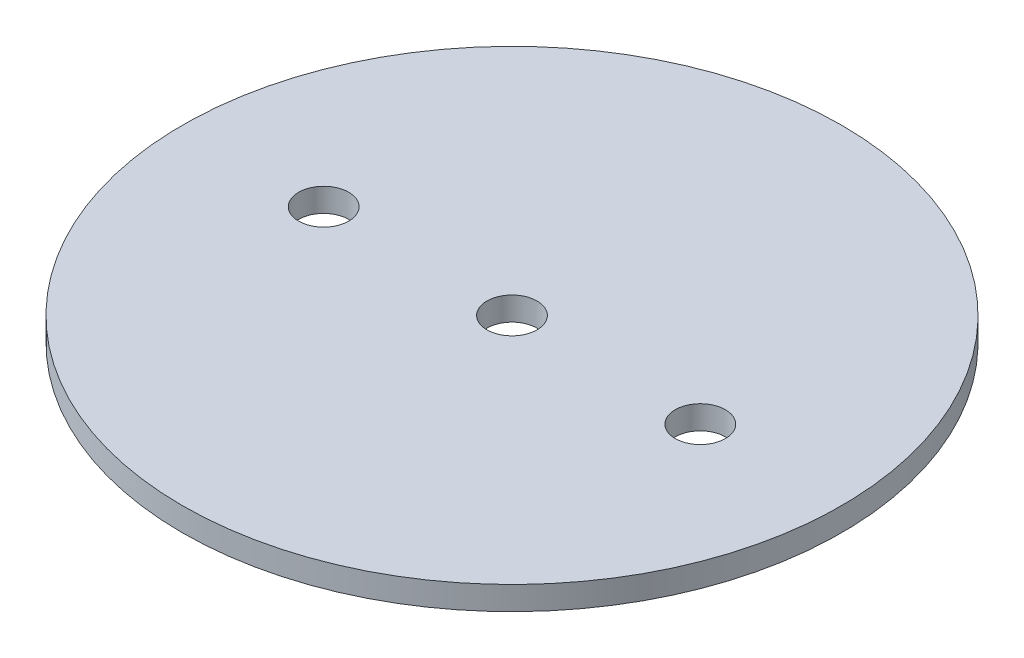
ISO-10303-21;
HEADER;
FILE_DESCRIPTION(('STEP AP214'),'2;1');
FILE_NAME('part.step','',(''),(''),'','','');
FILE_SCHEMA(('AUTOMOTIVE_DESIGN { 1 0 10303 214 1 1 1 1 }'));
ENDSEC;
DATA;
#1=APPLICATION_CONTEXT('core data for automotive mechanical design processes');
#2=APPLICATION_PROTOCOL_DEFINITION('international standard','automotive_design',2000,#1);
#3=PRODUCT_CONTEXT('',#1,'mechanical');
#4=PRODUCT('Part','Part','',(#3));
#5=PRODUCT_RELATED_PRODUCT_CATEGORY('part','',(#4));
#6=PRODUCT_DEFINITION_FORMATION('','',#4);
#7=PRODUCT_DEFINITION_CONTEXT('part definition',#1,'design');
#8=PRODUCT_DEFINITION('design','',#6,#7);
#9=PRODUCT_DEFINITION_SHAPE('','',#8);
#10=(LENGTH_UNIT() NAMED_UNIT(*) SI_UNIT(.MILLI.,.METRE.));
#11=(NAMED_UNIT(*) PLANE_ANGLE_UNIT() SI_UNIT($,.RADIAN.));
#12=(NAMED_UNIT(*) SI_UNIT($,.STERADIAN.) SOLID_ANGLE_UNIT());
#13=UNCERTAINTY_MEASURE_WITH_UNIT(LENGTH_MEASURE(1.E-05),#10,'distance_accuracy_value','');
#14=(GEOMETRIC_REPRESENTATION_CONTEXT(3) GLOBAL_UNCERTAINTY_ASSIGNED_CONTEXT((#13)) GLOBAL_UNIT_ASSIGNED_CONTEXT((#10,
#11,#12)) REPRESENTATION_CONTEXT('',''));
#15=CARTESIAN_POINT('',(0.,0.,0.));
#16=DIRECTION('',(0.,0.,1.));
#17=DIRECTION('',(1.,0.,0.));
#18=AXIS2_PLACEMENT_3D('',#15,#16,#17);
#19=CARTESIAN_POINT('',(0.,1.5875,0.));
#20=DIRECTION('',(0.,-1.,0.));
#21=DIRECTION('',(0.,0.,-1.));
#22=AXIS2_PLACEMENT_3D('',#19,#20,#21);
#23=CYLINDRICAL_SURFACE('',#22,44.45);
#24=CARTESIAN_POINT('',(0.,1.5875,0.));
#25=DIRECTION('',(0.,1.,0.));
#26=DIRECTION('',(0.,0.,1.));
#27=AXIS2_PLACEMENT_3D('',#24,#25,#26);
#28=CIRCLE('',#27,44.45);
#29=CARTESIAN_POINT('',(0.,1.5875,44.45));
#30=VERTEX_POINT('',#29);
#31=EDGE_CURVE('E10',#30,#30,#28,.T.);
#32=ORIENTED_EDGE('',*,*,#31,.F.);
#33=EDGE_LOOP('',(#32));
#34=FACE_BOUND('',#33,.T.);
#35=CARTESIAN_POINT('',(0.,-1.5875,0.));
#36=DIRECTION('',(0.,1.,0.));
#37=DIRECTION('',(0.,0.,1.));
#38=AXIS2_PLACEMENT_3D('',#35,#36,#37);
#39=CIRCLE('',#38,44.45);
#40=CARTESIAN_POINT('',(0.,-1.5875,44.45));
#41=VERTEX_POINT('',#40);
#42=EDGE_CURVE('E51',#41,#41,#39,.T.);
#43=ORIENTED_EDGE('',*,*,#42,.T.);
#44=EDGE_LOOP('',(#43));
#45=FACE_BOUND('',#44,.T.);
#46=ADVANCED_FACE('F43',(#34,#45),#23,.T.);
#47=CARTESIAN_POINT('',(0.,1.5875,0.));
#48=DIRECTION('',(0.,1.,0.));
#49=DIRECTION('',(0.,0.,1.));
#50=AXIS2_PLACEMENT_3D('',#47,#48,#49);
#51=PLANE('',#50);
#52=CARTESIAN_POINT('',(0.,1.5875,0.));
#53=DIRECTION('',(0.,1.,0.));
#54=DIRECTION('',(0.,0.,1.));
#55=AXIS2_PLACEMENT_3D('',#52,#53,#54);
#56=CIRCLE('',#55,3.37819999999999);
#57=CARTESIAN_POINT('',(0.,1.5875,3.37819999999999));
#58=VERTEX_POINT('',#57);
#59=EDGE_CURVE('E74',#58,#58,#56,.T.);
#60=ORIENTED_EDGE('',*,*,#59,.F.);
#61=EDGE_LOOP('',(#60));
#62=FACE_BOUND('',#61,.T.);
#63=CARTESIAN_POINT('',(-25.4,1.5875,0.));
#64=DIRECTION('',(0.,1.,0.));
#65=DIRECTION('',(0.,0.,1.));
#66=AXIS2_PLACEMENT_3D('',#63,#64,#65);
#67=CIRCLE('',#66,3.37819999999999);
#68=CARTESIAN_POINT('',(-25.4,1.5875,3.37819999999999));
#69=VERTEX_POINT('',#68);
#70=EDGE_CURVE('E66',#69,#69,#67,.T.);
#71=ORIENTED_EDGE('',*,*,#70,.F.);
#72=EDGE_LOOP('',(#71));
#73=FACE_BOUND('',#72,.T.);
#74=CARTESIAN_POINT('',(25.4,1.5875,0.));
#75=DIRECTION('',(0.,1.,0.));
#76=DIRECTION('',(0.,0.,1.));
#77=AXIS2_PLACEMENT_3D('',#74,#75,#76);
#78=CIRCLE('',#77,3.37819999999999);
#79=CARTESIAN_POINT('',(25.4,1.5875,3.37819999999998));
#80=VERTEX_POINT('',#79);
#81=EDGE_CURVE('E58',#80,#80,#78,.T.);
#82=ORIENTED_EDGE('',*,*,#81,.F.);
#83=EDGE_LOOP('',(#82));
#84=FACE_BOUND('',#83,.T.);
#85=ORIENTED_EDGE('',*,*,#31,.T.);
#86=EDGE_LOOP('',(#85));
#87=FACE_BOUND('',#86,.T.);
#88=ADVANCED_FACE('F82',(#62,#73,#84,#87),#51,.T.);
#89=CARTESIAN_POINT('',(0.,-1.5875,0.));
#90=DIRECTION('',(0.,1.,0.));
#91=DIRECTION('',(0.,0.,1.));
#92=AXIS2_PLACEMENT_3D('',#89,#90,#91);
#93=PLANE('',#92);
#94=CARTESIAN_POINT('',(0.,-1.5875,0.));
#95=DIRECTION('',(0.,1.,0.));
#96=DIRECTION('',(0.,0.,1.));
#97=AXIS2_PLACEMENT_3D('',#94,#95,#96);
#98=CIRCLE('',#97,3.37819999999999);
#99=CARTESIAN_POINT('',(0.,-1.5875,3.37819999999999));
#100=VERTEX_POINT('',#99);
#101=EDGE_CURVE('E70',#100,#100,#98,.T.);
#102=ORIENTED_EDGE('',*,*,#101,.T.);
#103=EDGE_LOOP('',(#102));
#104=FACE_BOUND('',#103,.T.);
#105=CARTESIAN_POINT('',(-25.4,-1.5875,0.));
#106=DIRECTION('',(0.,1.,0.));
#107=DIRECTION('',(0.,0.,1.));
#108=AXIS2_PLACEMENT_3D('',#105,#106,#107);
#109=CIRCLE('',#108,3.37819999999999);
#110=CARTESIAN_POINT('',(-25.4,-1.5875,3.37819999999999));
#111=VERTEX_POINT('',#110);
#112=EDGE_CURVE('E62',#111,#111,#109,.T.);
#113=ORIENTED_EDGE('',*,*,#112,.T.);
#114=EDGE_LOOP('',(#113));
#115=FACE_BOUND('',#114,.T.);
#116=CARTESIAN_POINT('',(25.4,-1.5875,0.));
#117=DIRECTION('',(0.,1.,0.));
#118=DIRECTION('',(0.,0.,1.));
#119=AXIS2_PLACEMENT_3D('',#116,#117,#118);
#120=CIRCLE('',#119,3.37819999999999);
#121=CARTESIAN_POINT('',(25.4,-1.5875,3.37819999999998));
#122=VERTEX_POINT('',#121);
#123=EDGE_CURVE('E46',#122,#122,#120,.T.);
#124=ORIENTED_EDGE('',*,*,#123,.T.);
#125=EDGE_LOOP('',(#124));
#126=FACE_BOUND('',#125,.T.);
#127=ORIENTED_EDGE('',*,*,#42,.F.);
#128=EDGE_LOOP('',(#127));
#129=FACE_BOUND('',#128,.T.);
#130=ADVANCED_FACE('F85',(#104,#115,#126,#129),#93,.F.);
#131=CARTESIAN_POINT('',(25.4,1.5875,0.));
#132=DIRECTION('',(0.,1.,0.));
#133=DIRECTION('',(0.,0.,1.));
#134=AXIS2_PLACEMENT_3D('',#131,#132,#133);
#135=CYLINDRICAL_SURFACE('',#134,3.37819999999999);
#136=ORIENTED_EDGE('',*,*,#81,.T.);
#137=EDGE_LOOP('',(#136));
#138=FACE_BOUND('',#137,.T.);
#139=ORIENTED_EDGE('',*,*,#123,.F.);
#140=EDGE_LOOP('',(#139));
#141=FACE_BOUND('',#140,.T.);
#142=ADVANCED_FACE('F91',(#138,#141),#135,.F.);
#143=CARTESIAN_POINT('',(-25.4,1.5875,0.));
#144=DIRECTION('',(0.,1.,0.));
#145=DIRECTION('',(0.,0.,1.));
#146=AXIS2_PLACEMENT_3D('',#143,#144,#145);
#147=CYLINDRICAL_SURFACE('',#146,3.37819999999999);
#148=ORIENTED_EDGE('',*,*,#70,.T.);
#149=EDGE_LOOP('',(#148));
#150=FACE_BOUND('',#149,.T.);
#151=ORIENTED_EDGE('',*,*,#112,.F.);
#152=EDGE_LOOP('',(#151));
#153=FACE_BOUND('',#152,.T.);
#154=ADVANCED_FACE('F94',(#150,#153),#147,.F.);
#155=CARTESIAN_POINT('',(0.,1.5875,0.));
#156=DIRECTION('',(0.,1.,0.));
#157=DIRECTION('',(0.,0.,1.));
#158=AXIS2_PLACEMENT_3D('',#155,#156,#157);
#159=CYLINDRICAL_SURFACE('',#158,3.37819999999999);
#160=ORIENTED_EDGE('',*,*,#59,.T.);
#161=EDGE_LOOP('',(#160));
#162=FACE_BOUND('',#161,.T.);
#163=ORIENTED_EDGE('',*,*,#101,.F.);
#164=EDGE_LOOP('',(#163));
#165=FACE_BOUND('',#164,.T.);
#166=ADVANCED_FACE('F79',(#162,#165),#159,.F.);
#167=CLOSED_SHELL('',(#46,#88,#130,#142,#154,#166));
#168=MANIFOLD_SOLID_BREP('B2',#167);
#169=ADVANCED_BREP_SHAPE_REPRESENTATION('',(#18,#168),#14);
#170=SHAPE_DEFINITION_REPRESENTATION(#9,#169);
ENDSEC;
END-ISO-10303-21;
